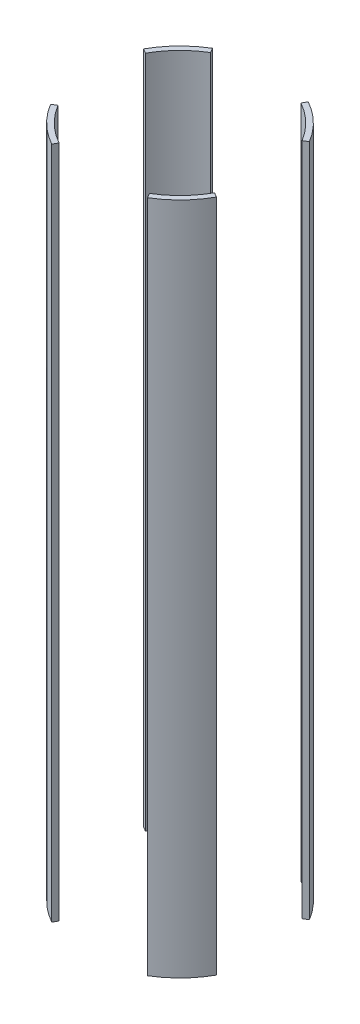
ISO-10303-21;
HEADER;
FILE_DESCRIPTION(('STEP AP214'),'2;1');
FILE_NAME('part.step','',(''),(''),'','','');
FILE_SCHEMA(('AUTOMOTIVE_DESIGN { 1 0 10303 214 1 1 1 1 }'));
ENDSEC;
DATA;
#1=APPLICATION_CONTEXT('core data for automotive mechanical design processes');
#2=APPLICATION_PROTOCOL_DEFINITION('international standard','automotive_design',2000,#1);
#3=PRODUCT_CONTEXT('',#1,'mechanical');
#4=PRODUCT('Part','Part','',(#3));
#5=PRODUCT_RELATED_PRODUCT_CATEGORY('part','',(#4));
#6=PRODUCT_DEFINITION_FORMATION('','',#4);
#7=PRODUCT_DEFINITION_CONTEXT('part definition',#1,'design');
#8=PRODUCT_DEFINITION('design','',#6,#7);
#9=PRODUCT_DEFINITION_SHAPE('','',#8);
#10=(LENGTH_UNIT() NAMED_UNIT(*) SI_UNIT(.MILLI.,.METRE.));
#11=(NAMED_UNIT(*) PLANE_ANGLE_UNIT() SI_UNIT($,.RADIAN.));
#12=(NAMED_UNIT(*) SI_UNIT($,.STERADIAN.) SOLID_ANGLE_UNIT());
#13=UNCERTAINTY_MEASURE_WITH_UNIT(LENGTH_MEASURE(1.E-05),#10,'distance_accuracy_value','');
#14=(GEOMETRIC_REPRESENTATION_CONTEXT(3) GLOBAL_UNCERTAINTY_ASSIGNED_CONTEXT((#13)) GLOBAL_UNIT_ASSIGNED_CONTEXT((#10,
#11,#12)) REPRESENTATION_CONTEXT('',''));
#15=CARTESIAN_POINT('',(0.,0.,0.));
#16=DIRECTION('',(0.,0.,1.));
#17=DIRECTION('',(1.,0.,0.));
#18=AXIS2_PLACEMENT_3D('',#15,#16,#17);
#19=CARTESIAN_POINT('',(0.,-317.5,0.));
#20=DIRECTION('',(0.,1.,0.));
#21=DIRECTION('',(0.,0.,1.));
#22=AXIS2_PLACEMENT_3D('',#19,#20,#21);
#23=PLANE('',#22);
#24=DIRECTION('',(0.48581550952375,0.,-0.874061376967418));
#25=VECTOR('',#24,1.);
#26=CARTESIAN_POINT('',(0.,-317.5,0.));
#27=LINE('',#26,#25);
#28=CARTESIAN_POINT('',(-43.1889987966614,-317.5,77.7040564124034));
#29=VERTEX_POINT('',#28);
#30=CARTESIAN_POINT('',(-40.7210560082808,-317.5,73.263824617409));
#31=VERTEX_POINT('',#30);
#32=EDGE_CURVE('E13',#29,#31,#27,.T.);
#33=ORIENTED_EDGE('',*,*,#32,.F.);
#34=CARTESIAN_POINT('',(0.,-317.5,0.));
#35=DIRECTION('',(0.,1.,0.));
#36=DIRECTION('',(0.,0.,1.));
#37=AXIS2_PLACEMENT_3D('',#34,#35,#36);
#38=CIRCLE('',#37,88.9);
#39=CARTESIAN_POINT('',(-76.2547983281261,-317.5,45.6991874319097));
#40=VERTEX_POINT('',#39);
#41=EDGE_CURVE('E274',#40,#29,#38,.T.);
#42=ORIENTED_EDGE('',*,*,#41,.F.);
#43=DIRECTION('',(0.857759261283758,0.,-0.514051602158714));
#44=VECTOR('',#43,1.);
#45=CARTESIAN_POINT('',(0.,-317.5,0.));
#46=LINE('',#45,#44);
#47=CARTESIAN_POINT('',(-71.8973812808046,-317.5,43.0878052929434));
#48=VERTEX_POINT('',#47);
#49=EDGE_CURVE('E269',#40,#48,#46,.T.);
#50=ORIENTED_EDGE('',*,*,#49,.T.);
#51=CARTESIAN_POINT('',(0.,-317.5,0.));
#52=DIRECTION('',(0.,1.,0.));
#53=DIRECTION('',(0.,0.,1.));
#54=AXIS2_PLACEMENT_3D('',#51,#52,#53);
#55=CIRCLE('',#54,83.82);
#56=EDGE_CURVE('E228',#48,#31,#55,.T.);
#57=ORIENTED_EDGE('',*,*,#56,.T.);
#58=EDGE_LOOP('',(#33,#42,#50,#57));
#59=FACE_BOUND('',#58,.T.);
#60=ADVANCED_FACE('F225',(#59),#23,.F.);
#61=CARTESIAN_POINT('',(0.,317.5,0.));
#62=DIRECTION('',(0.,1.,0.));
#63=DIRECTION('',(0.,0.,1.));
#64=AXIS2_PLACEMENT_3D('',#61,#62,#63);
#65=PLANE('',#64);
#66=CARTESIAN_POINT('',(0.,317.5,0.));
#67=DIRECTION('',(0.,1.,0.));
#68=DIRECTION('',(0.,0.,1.));
#69=AXIS2_PLACEMENT_3D('',#66,#67,#68);
#70=CIRCLE('',#69,88.9);
#71=CARTESIAN_POINT('',(-76.2547983281261,317.5,45.6991874319097));
#72=VERTEX_POINT('',#71);
#73=CARTESIAN_POINT('',(-43.1889987966614,317.5,77.7040564124034));
#74=VERTEX_POINT('',#73);
#75=EDGE_CURVE('E280',#72,#74,#70,.T.);
#76=ORIENTED_EDGE('',*,*,#75,.T.);
#77=DIRECTION('',(0.48581550952375,0.,-0.874061376967418));
#78=VECTOR('',#77,1.);
#79=CARTESIAN_POINT('',(0.,317.5,0.));
#80=LINE('',#79,#78);
#81=CARTESIAN_POINT('',(-40.7210560082808,317.5,73.263824617409));
#82=VERTEX_POINT('',#81);
#83=EDGE_CURVE('E241',#74,#82,#80,.T.);
#84=ORIENTED_EDGE('',*,*,#83,.T.);
#85=CARTESIAN_POINT('',(0.,317.5,0.));
#86=DIRECTION('',(0.,1.,0.));
#87=DIRECTION('',(0.,0.,1.));
#88=AXIS2_PLACEMENT_3D('',#85,#86,#87);
#89=CIRCLE('',#88,83.82);
#90=CARTESIAN_POINT('',(-71.8973812808046,317.5,43.0878052929434));
#91=VERTEX_POINT('',#90);
#92=EDGE_CURVE('E282',#91,#82,#89,.T.);
#93=ORIENTED_EDGE('',*,*,#92,.F.);
#94=DIRECTION('',(0.857759261283759,0.,-0.514051602158714));
#95=VECTOR('',#94,1.);
#96=CARTESIAN_POINT('',(0.,317.5,0.));
#97=LINE('',#96,#95);
#98=EDGE_CURVE('E266',#72,#91,#97,.T.);
#99=ORIENTED_EDGE('',*,*,#98,.F.);
#100=EDGE_LOOP('',(#76,#84,#93,#99));
#101=FACE_BOUND('',#100,.T.);
#102=ADVANCED_FACE('F279',(#101),#65,.T.);
#103=CARTESIAN_POINT('',(0.,317.5,0.));
#104=DIRECTION('',(0.,-1.,0.));
#105=DIRECTION('',(0.,0.,-1.));
#106=AXIS2_PLACEMENT_3D('',#103,#104,#105);
#107=CYLINDRICAL_SURFACE('',#106,88.9);
#108=DIRECTION('',(0.,-1.,0.));
#109=VECTOR('',#108,1.);
#110=CARTESIAN_POINT('',(-43.1889987966614,317.5,77.7040564124034));
#111=LINE('',#110,#109);
#112=EDGE_CURVE('E233',#74,#29,#111,.T.);
#113=ORIENTED_EDGE('',*,*,#112,.F.);
#114=ORIENTED_EDGE('',*,*,#75,.F.);
#115=DIRECTION('',(0.,-1.,0.));
#116=VECTOR('',#115,1.);
#117=CARTESIAN_POINT('',(-76.2547983281261,317.5,45.6991874319097));
#118=LINE('',#117,#116);
#119=EDGE_CURVE('E263',#72,#40,#118,.T.);
#120=ORIENTED_EDGE('',*,*,#119,.T.);
#121=ORIENTED_EDGE('',*,*,#41,.T.);
#122=EDGE_LOOP('',(#113,#114,#120,#121));
#123=FACE_BOUND('',#122,.T.);
#124=ADVANCED_FACE('F285',(#123),#107,.T.);
#125=CARTESIAN_POINT('',(0.,317.5,0.));
#126=DIRECTION('',(0.,-1.,0.));
#127=DIRECTION('',(0.,0.,-1.));
#128=AXIS2_PLACEMENT_3D('',#125,#126,#127);
#129=CYLINDRICAL_SURFACE('',#128,83.82);
#130=ORIENTED_EDGE('',*,*,#92,.T.);
#131=DIRECTION('',(0.,-1.,0.));
#132=VECTOR('',#131,1.);
#133=CARTESIAN_POINT('',(-40.7210560082807,317.5,73.2638246174089));
#134=LINE('',#133,#132);
#135=EDGE_CURVE('E245',#82,#31,#134,.T.);
#136=ORIENTED_EDGE('',*,*,#135,.T.);
#137=ORIENTED_EDGE('',*,*,#56,.F.);
#138=DIRECTION('',(0.,-1.,0.));
#139=VECTOR('',#138,1.);
#140=CARTESIAN_POINT('',(-71.8973812808046,317.5,43.0878052929434));
#141=LINE('',#140,#139);
#142=EDGE_CURVE('E283',#91,#48,#141,.T.);
#143=ORIENTED_EDGE('',*,*,#142,.F.);
#144=EDGE_LOOP('',(#130,#136,#137,#143));
#145=FACE_BOUND('',#144,.T.);
#146=ADVANCED_FACE('F299',(#145),#129,.F.);
#147=CARTESIAN_POINT('',(0.,-317.5,0.));
#148=DIRECTION('',(0.514051602158714,0.,0.857759261283758));
#149=DIRECTION('',(0.857759261283759,0.,-0.514051602158714));
#150=AXIS2_PLACEMENT_3D('',#147,#148,#149);
#151=PLANE('',#150);
#152=ORIENTED_EDGE('',*,*,#142,.T.);
#153=ORIENTED_EDGE('',*,*,#49,.F.);
#154=ORIENTED_EDGE('',*,*,#119,.F.);
#155=ORIENTED_EDGE('',*,*,#98,.T.);
#156=EDGE_LOOP('',(#152,#153,#154,#155));
#157=FACE_BOUND('',#156,.T.);
#158=ADVANCED_FACE('F265',(#157),#151,.F.);
#159=CARTESIAN_POINT('',(0.,-317.5,0.));
#160=DIRECTION('',(0.874061376967418,0.,0.48581550952375));
#161=DIRECTION('',(0.485815509523751,0.,-0.874061376967418));
#162=AXIS2_PLACEMENT_3D('',#159,#160,#161);
#163=PLANE('',#162);
#164=ORIENTED_EDGE('',*,*,#112,.T.);
#165=ORIENTED_EDGE('',*,*,#32,.T.);
#166=ORIENTED_EDGE('',*,*,#135,.F.);
#167=ORIENTED_EDGE('',*,*,#83,.F.);
#168=EDGE_LOOP('',(#164,#165,#166,#167));
#169=FACE_BOUND('',#168,.T.);
#170=ADVANCED_FACE('F297',(#169),#163,.T.);
#171=CLOSED_SHELL('',(#60,#102,#124,#146,#158,#170));
#172=MANIFOLD_SOLID_BREP('B2',#171);
#173=CARTESIAN_POINT('',(0.,317.5,0.));
#174=DIRECTION('',(0.,-1.,0.));
#175=DIRECTION('',(0.,0.,-1.));
#176=AXIS2_PLACEMENT_3D('',#173,#174,#175);
#177=CYLINDRICAL_SURFACE('',#176,83.82);
#178=DIRECTION('',(0.,-1.,0.));
#179=VECTOR('',#178,1.);
#180=CARTESIAN_POINT('',(-73.2638246174091,317.5,-40.7210560082805));
#181=LINE('',#180,#179);
#182=CARTESIAN_POINT('',(-73.2638246174091,-317.5,-40.7210560082805));
#183=VERTEX_POINT('',#182);
#184=CARTESIAN_POINT('',(-73.2638246174091,317.5,-40.7210560082805));
#185=VERTEX_POINT('',#184);
#186=EDGE_CURVE('E367',#183,#185,#181,.F.);
#187=ORIENTED_EDGE('',*,*,#186,.F.);
#188=CARTESIAN_POINT('',(0.,-317.5,0.));
#189=DIRECTION('',(0.,1.,0.));
#190=DIRECTION('',(0.,0.,1.));
#191=AXIS2_PLACEMENT_3D('',#188,#189,#190);
#192=CIRCLE('',#191,83.82);
#193=CARTESIAN_POINT('',(-43.0878052929431,-317.5,-71.8973812808048));
#194=VERTEX_POINT('',#193);
#195=EDGE_CURVE('E361',#194,#183,#192,.T.);
#196=ORIENTED_EDGE('',*,*,#195,.F.);
#197=DIRECTION('',(0.,-1.,0.));
#198=VECTOR('',#197,1.);
#199=CARTESIAN_POINT('',(-43.0878052929431,317.5,-71.8973812808048));
#200=LINE('',#199,#198);
#201=CARTESIAN_POINT('',(-43.0878052929431,317.5,-71.8973812808048));
#202=VERTEX_POINT('',#201);
#203=EDGE_CURVE('E415',#202,#194,#200,.T.);
#204=ORIENTED_EDGE('',*,*,#203,.F.);
#205=CARTESIAN_POINT('',(0.,317.5,0.));
#206=DIRECTION('',(0.,1.,0.));
#207=DIRECTION('',(0.,0.,1.));
#208=AXIS2_PLACEMENT_3D('',#205,#206,#207);
#209=CIRCLE('',#208,83.82);
#210=EDGE_CURVE('E421',#202,#185,#209,.T.);
#211=ORIENTED_EDGE('',*,*,#210,.T.);
#212=EDGE_LOOP('',(#187,#196,#204,#211));
#213=FACE_BOUND('',#212,.T.);
#214=ADVANCED_FACE('F358',(#213),#177,.F.);
#215=CARTESIAN_POINT('',(0.,317.5,0.));
#216=DIRECTION('',(0.,-1.,0.));
#217=DIRECTION('',(0.,0.,-1.));
#218=AXIS2_PLACEMENT_3D('',#215,#216,#217);
#219=CYLINDRICAL_SURFACE('',#218,88.9);
#220=CARTESIAN_POINT('',(0.,-317.5,0.));
#221=DIRECTION('',(0.,1.,0.));
#222=DIRECTION('',(0.,0.,1.));
#223=AXIS2_PLACEMENT_3D('',#220,#221,#222);
#224=CIRCLE('',#223,88.9);
#225=CARTESIAN_POINT('',(-45.6991874319094,-317.5,-76.2547983281263));
#226=VERTEX_POINT('',#225);
#227=CARTESIAN_POINT('',(-77.7040564124036,-317.5,-43.1889987966612));
#228=VERTEX_POINT('',#227);
#229=EDGE_CURVE('E407',#226,#228,#224,.T.);
#230=ORIENTED_EDGE('',*,*,#229,.T.);
#231=DIRECTION('',(0.,-1.,0.));
#232=VECTOR('',#231,1.);
#233=CARTESIAN_POINT('',(-77.7040564124036,317.5,-43.1889987966611));
#234=LINE('',#233,#232);
#235=CARTESIAN_POINT('',(-77.7040564124036,317.5,-43.1889987966612));
#236=VERTEX_POINT('',#235);
#237=EDGE_CURVE('E395',#228,#236,#234,.F.);
#238=ORIENTED_EDGE('',*,*,#237,.T.);
#239=CARTESIAN_POINT('',(0.,317.5,0.));
#240=DIRECTION('',(0.,1.,0.));
#241=DIRECTION('',(0.,0.,1.));
#242=AXIS2_PLACEMENT_3D('',#239,#240,#241);
#243=CIRCLE('',#242,88.9);
#244=CARTESIAN_POINT('',(-45.6991874319094,317.5,-76.2547983281263));
#245=VERTEX_POINT('',#244);
#246=EDGE_CURVE('E405',#245,#236,#243,.T.);
#247=ORIENTED_EDGE('',*,*,#246,.F.);
#248=DIRECTION('',(0.,-1.,0.));
#249=VECTOR('',#248,1.);
#250=CARTESIAN_POINT('',(-45.6991874319094,317.5,-76.2547983281263));
#251=LINE('',#250,#249);
#252=EDGE_CURVE('E408',#245,#226,#251,.T.);
#253=ORIENTED_EDGE('',*,*,#252,.T.);
#254=EDGE_LOOP('',(#230,#238,#247,#253));
#255=FACE_BOUND('',#254,.T.);
#256=ADVANCED_FACE('F403',(#255),#219,.T.);
#257=CARTESIAN_POINT('',(0.,-317.5,0.));
#258=DIRECTION('',(0.,1.,0.));
#259=DIRECTION('',(0.,0.,1.));
#260=AXIS2_PLACEMENT_3D('',#257,#258,#259);
#261=PLANE('',#260);
#262=ORIENTED_EDGE('',*,*,#195,.T.);
#263=DIRECTION('',(-0.87406137696742,0.,-0.485815509523748));
#264=VECTOR('',#263,1.);
#265=CARTESIAN_POINT('',(0.,-317.5,0.));
#266=LINE('',#265,#264);
#267=EDGE_CURVE('E375',#183,#228,#266,.T.);
#268=ORIENTED_EDGE('',*,*,#267,.T.);
#269=ORIENTED_EDGE('',*,*,#229,.F.);
#270=DIRECTION('',(0.514051602158711,0.,0.85775926128376));
#271=VECTOR('',#270,1.);
#272=CARTESIAN_POINT('',(0.,-317.5,0.));
#273=LINE('',#272,#271);
#274=EDGE_CURVE('E413',#226,#194,#273,.T.);
#275=ORIENTED_EDGE('',*,*,#274,.T.);
#276=EDGE_LOOP('',(#262,#268,#269,#275));
#277=FACE_BOUND('',#276,.T.);
#278=ADVANCED_FACE('F431',(#277),#261,.F.);
#279=CARTESIAN_POINT('',(0.,317.5,0.));
#280=DIRECTION('',(0.,1.,0.));
#281=DIRECTION('',(0.,0.,1.));
#282=AXIS2_PLACEMENT_3D('',#279,#280,#281);
#283=PLANE('',#282);
#284=DIRECTION('',(-0.87406137696742,0.,-0.485815509523748));
#285=VECTOR('',#284,1.);
#286=CARTESIAN_POINT('',(0.,317.5,0.));
#287=LINE('',#286,#285);
#288=EDGE_CURVE('E223',#185,#236,#287,.T.);
#289=ORIENTED_EDGE('',*,*,#288,.F.);
#290=ORIENTED_EDGE('',*,*,#210,.F.);
#291=DIRECTION('',(0.514051602158711,0.,0.85775926128376));
#292=VECTOR('',#291,1.);
#293=CARTESIAN_POINT('',(0.,317.5,0.));
#294=LINE('',#293,#292);
#295=EDGE_CURVE('E412',#245,#202,#294,.T.);
#296=ORIENTED_EDGE('',*,*,#295,.F.);
#297=ORIENTED_EDGE('',*,*,#246,.T.);
#298=EDGE_LOOP('',(#289,#290,#296,#297));
#299=FACE_BOUND('',#298,.T.);
#300=ADVANCED_FACE('F411',(#299),#283,.T.);
#301=CARTESIAN_POINT('',(0.,-317.5,0.));
#302=DIRECTION('',(-0.85775926128376,0.,0.514051602158711));
#303=DIRECTION('',(0.514051602158711,0.,0.857759261283761));
#304=AXIS2_PLACEMENT_3D('',#301,#302,#303);
#305=PLANE('',#304);
#306=ORIENTED_EDGE('',*,*,#295,.T.);
#307=ORIENTED_EDGE('',*,*,#203,.T.);
#308=ORIENTED_EDGE('',*,*,#274,.F.);
#309=ORIENTED_EDGE('',*,*,#252,.F.);
#310=EDGE_LOOP('',(#306,#307,#308,#309));
#311=FACE_BOUND('',#310,.T.);
#312=ADVANCED_FACE('F432',(#311),#305,.F.);
#313=CARTESIAN_POINT('',(0.,-317.5,0.));
#314=DIRECTION('',(0.485815509523747,0.,-0.87406137696742));
#315=DIRECTION('',(-0.87406137696742,0.,-0.485815509523748));
#316=AXIS2_PLACEMENT_3D('',#313,#314,#315);
#317=PLANE('',#316);
#318=ORIENTED_EDGE('',*,*,#186,.T.);
#319=ORIENTED_EDGE('',*,*,#288,.T.);
#320=ORIENTED_EDGE('',*,*,#237,.F.);
#321=ORIENTED_EDGE('',*,*,#267,.F.);
#322=EDGE_LOOP('',(#318,#319,#320,#321));
#323=FACE_BOUND('',#322,.T.);
#324=ADVANCED_FACE('F394',(#323),#317,.F.);
#325=CLOSED_SHELL('',(#214,#256,#278,#300,#312,#324));
#326=MANIFOLD_SOLID_BREP('B7',#325);
#327=CARTESIAN_POINT('',(0.,317.5,0.));
#328=DIRECTION('',(0.,1.,0.));
#329=DIRECTION('',(0.,0.,1.));
#330=AXIS2_PLACEMENT_3D('',#327,#328,#329);
#331=PLANE('',#330);
#332=DIRECTION('',(0.485815509523751,0.,-0.874061376967418));
#333=VECTOR('',#332,1.);
#334=CARTESIAN_POINT('',(0.,317.5,0.));
#335=LINE('',#334,#333);
#336=CARTESIAN_POINT('',(40.7210560082808,317.5,-73.2638246174089));
#337=VERTEX_POINT('',#336);
#338=CARTESIAN_POINT('',(43.1889987966614,317.5,-77.7040564124034));
#339=VERTEX_POINT('',#338);
#340=EDGE_CURVE('E356',#337,#339,#335,.T.);
#341=ORIENTED_EDGE('',*,*,#340,.F.);
#342=CARTESIAN_POINT('',(0.,317.5,0.));
#343=DIRECTION('',(0.,1.,0.));
#344=DIRECTION('',(0.,0.,1.));
#345=AXIS2_PLACEMENT_3D('',#342,#343,#344);
#346=CIRCLE('',#345,83.82);
#347=CARTESIAN_POINT('',(71.8973812808046,317.5,-43.0878052929434));
#348=VERTEX_POINT('',#347);
#349=EDGE_CURVE('E538',#348,#337,#346,.T.);
#350=ORIENTED_EDGE('',*,*,#349,.F.);
#351=DIRECTION('',(0.857759261283759,0.,-0.514051602158714));
#352=VECTOR('',#351,1.);
#353=CARTESIAN_POINT('',(0.,317.5,0.));
#354=LINE('',#353,#352);
#355=CARTESIAN_POINT('',(76.2547983281261,317.5,-45.6991874319097));
#356=VERTEX_POINT('',#355);
#357=EDGE_CURVE('E551',#348,#356,#354,.T.);
#358=ORIENTED_EDGE('',*,*,#357,.T.);
#359=CARTESIAN_POINT('',(0.,317.5,0.));
#360=DIRECTION('',(0.,1.,0.));
#361=DIRECTION('',(0.,0.,1.));
#362=AXIS2_PLACEMENT_3D('',#359,#360,#361);
#363=CIRCLE('',#362,88.9);
#364=EDGE_CURVE('E540',#356,#339,#363,.T.);
#365=ORIENTED_EDGE('',*,*,#364,.T.);
#366=EDGE_LOOP('',(#341,#350,#358,#365));
#367=FACE_BOUND('',#366,.T.);
#368=ADVANCED_FACE('F490',(#367),#331,.T.);
#369=CARTESIAN_POINT('',(0.,-317.5,0.));
#370=DIRECTION('',(0.,1.,0.));
#371=DIRECTION('',(0.,0.,1.));
#372=AXIS2_PLACEMENT_3D('',#369,#370,#371);
#373=PLANE('',#372);
#374=CARTESIAN_POINT('',(0.,-317.5,0.));
#375=DIRECTION('',(0.,1.,0.));
#376=DIRECTION('',(0.,0.,1.));
#377=AXIS2_PLACEMENT_3D('',#374,#375,#376);
#378=CIRCLE('',#377,83.82);
#379=CARTESIAN_POINT('',(71.8973812808046,-317.5,-43.0878052929434));
#380=VERTEX_POINT('',#379);
#381=CARTESIAN_POINT('',(40.7210560082808,-317.5,-73.2638246174089));
#382=VERTEX_POINT('',#381);
#383=EDGE_CURVE('E493',#380,#382,#378,.T.);
#384=ORIENTED_EDGE('',*,*,#383,.T.);
#385=DIRECTION('',(0.485815509523751,0.,-0.874061376967418));
#386=VECTOR('',#385,1.);
#387=CARTESIAN_POINT('',(0.,-317.5,0.));
#388=LINE('',#387,#386);
#389=CARTESIAN_POINT('',(43.1889987966614,-317.5,-77.7040564124034));
#390=VERTEX_POINT('',#389);
#391=EDGE_CURVE('E524',#382,#390,#388,.T.);
#392=ORIENTED_EDGE('',*,*,#391,.T.);
#393=CARTESIAN_POINT('',(0.,-317.5,0.));
#394=DIRECTION('',(0.,1.,0.));
#395=DIRECTION('',(0.,0.,1.));
#396=AXIS2_PLACEMENT_3D('',#393,#394,#395);
#397=CIRCLE('',#396,88.9);
#398=CARTESIAN_POINT('',(76.2547983281261,-317.5,-45.6991874319097));
#399=VERTEX_POINT('',#398);
#400=EDGE_CURVE('E548',#399,#390,#397,.T.);
#401=ORIENTED_EDGE('',*,*,#400,.F.);
#402=DIRECTION('',(0.857759261283759,0.,-0.514051602158714));
#403=VECTOR('',#402,1.);
#404=CARTESIAN_POINT('',(0.,-317.5,0.));
#405=LINE('',#404,#403);
#406=EDGE_CURVE('E532',#380,#399,#405,.T.);
#407=ORIENTED_EDGE('',*,*,#406,.F.);
#408=EDGE_LOOP('',(#384,#392,#401,#407));
#409=FACE_BOUND('',#408,.T.);
#410=ADVANCED_FACE('F564',(#409),#373,.F.);
#411=CARTESIAN_POINT('',(0.,317.5,0.));
#412=DIRECTION('',(0.,-1.,0.));
#413=DIRECTION('',(0.,0.,-1.));
#414=AXIS2_PLACEMENT_3D('',#411,#412,#413);
#415=CYLINDRICAL_SURFACE('',#414,88.9);
#416=ORIENTED_EDGE('',*,*,#400,.T.);
#417=DIRECTION('',(0.,-1.,0.));
#418=VECTOR('',#417,1.);
#419=CARTESIAN_POINT('',(43.1889987966614,317.5,-77.7040564124034));
#420=LINE('',#419,#418);
#421=EDGE_CURVE('E507',#390,#339,#420,.F.);
#422=ORIENTED_EDGE('',*,*,#421,.T.);
#423=ORIENTED_EDGE('',*,*,#364,.F.);
#424=DIRECTION('',(0.,-1.,0.));
#425=VECTOR('',#424,1.);
#426=CARTESIAN_POINT('',(76.2547983281261,317.5,-45.6991874319097));
#427=LINE('',#426,#425);
#428=EDGE_CURVE('E544',#399,#356,#427,.F.);
#429=ORIENTED_EDGE('',*,*,#428,.F.);
#430=EDGE_LOOP('',(#416,#422,#423,#429));
#431=FACE_BOUND('',#430,.T.);
#432=ADVANCED_FACE('F563',(#431),#415,.T.);
#433=CARTESIAN_POINT('',(0.,317.5,0.));
#434=DIRECTION('',(0.,-1.,0.));
#435=DIRECTION('',(0.,0.,-1.));
#436=AXIS2_PLACEMENT_3D('',#433,#434,#435);
#437=CYLINDRICAL_SURFACE('',#436,83.82);
#438=DIRECTION('',(0.,-1.,0.));
#439=VECTOR('',#438,1.);
#440=CARTESIAN_POINT('',(40.7210560082808,317.5,-73.2638246174089));
#441=LINE('',#440,#439);
#442=EDGE_CURVE('E499',#382,#337,#441,.F.);
#443=ORIENTED_EDGE('',*,*,#442,.F.);
#444=ORIENTED_EDGE('',*,*,#383,.F.);
#445=DIRECTION('',(0.,-1.,0.));
#446=VECTOR('',#445,1.);
#447=CARTESIAN_POINT('',(71.8973812808046,317.5,-43.0878052929434));
#448=LINE('',#447,#446);
#449=EDGE_CURVE('E543',#380,#348,#448,.F.);
#450=ORIENTED_EDGE('',*,*,#449,.T.);
#451=ORIENTED_EDGE('',*,*,#349,.T.);
#452=EDGE_LOOP('',(#443,#444,#450,#451));
#453=FACE_BOUND('',#452,.T.);
#454=ADVANCED_FACE('F542',(#453),#437,.F.);
#455=CARTESIAN_POINT('',(0.,-317.5,0.));
#456=DIRECTION('',(0.514051602158714,0.,0.857759261283758));
#457=DIRECTION('',(0.857759261283759,0.,-0.514051602158714));
#458=AXIS2_PLACEMENT_3D('',#455,#456,#457);
#459=PLANE('',#458);
#460=ORIENTED_EDGE('',*,*,#428,.T.);
#461=ORIENTED_EDGE('',*,*,#357,.F.);
#462=ORIENTED_EDGE('',*,*,#449,.F.);
#463=ORIENTED_EDGE('',*,*,#406,.T.);
#464=EDGE_LOOP('',(#460,#461,#462,#463));
#465=FACE_BOUND('',#464,.T.);
#466=ADVANCED_FACE('F559',(#465),#459,.T.);
#467=CARTESIAN_POINT('',(0.,-317.5,0.));
#468=DIRECTION('',(0.874061376967418,0.,0.485815509523751));
#469=DIRECTION('',(0.485815509523751,0.,-0.874061376967418));
#470=AXIS2_PLACEMENT_3D('',#467,#468,#469);
#471=PLANE('',#470);
#472=ORIENTED_EDGE('',*,*,#391,.F.);
#473=ORIENTED_EDGE('',*,*,#442,.T.);
#474=ORIENTED_EDGE('',*,*,#340,.T.);
#475=ORIENTED_EDGE('',*,*,#421,.F.);
#476=EDGE_LOOP('',(#472,#473,#474,#475));
#477=FACE_BOUND('',#476,.T.);
#478=ADVANCED_FACE('F527',(#477),#471,.F.);
#479=CLOSED_SHELL('',(#368,#410,#432,#454,#466,#478));
#480=MANIFOLD_SOLID_BREP('B217',#479);
#481=CARTESIAN_POINT('',(0.,-317.5,0.));
#482=DIRECTION('',(0.485815509523748,0.,-0.874061376967419));
#483=DIRECTION('',(-0.87406137696742,0.,-0.485815509523748));
#484=AXIS2_PLACEMENT_3D('',#481,#482,#483);
#485=PLANE('',#484);
#486=DIRECTION('',(0.,-1.,0.));
#487=VECTOR('',#486,1.);
#488=CARTESIAN_POINT('',(77.7040564124036,317.5,43.1889987966612));
#489=LINE('',#488,#487);
#490=CARTESIAN_POINT('',(77.7040564124036,317.5,43.1889987966612));
#491=VERTEX_POINT('',#490);
#492=CARTESIAN_POINT('',(77.7040564124036,-317.5,43.1889987966612));
#493=VERTEX_POINT('',#492);
#494=EDGE_CURVE('E671',#491,#493,#489,.T.);
#495=ORIENTED_EDGE('',*,*,#494,.T.);
#496=DIRECTION('',(-0.87406137696742,0.,-0.485815509523748));
#497=VECTOR('',#496,1.);
#498=CARTESIAN_POINT('',(0.,-317.5,0.));
#499=LINE('',#498,#497);
#500=CARTESIAN_POINT('',(73.2638246174091,-317.5,40.7210560082805));
#501=VERTEX_POINT('',#500);
#502=EDGE_CURVE('E680',#493,#501,#499,.T.);
#503=ORIENTED_EDGE('',*,*,#502,.T.);
#504=DIRECTION('',(0.,-1.,0.));
#505=VECTOR('',#504,1.);
#506=CARTESIAN_POINT('',(73.2638246174091,317.5,40.7210560082805));
#507=LINE('',#506,#505);
#508=CARTESIAN_POINT('',(73.2638246174091,317.5,40.7210560082805));
#509=VERTEX_POINT('',#508);
#510=EDGE_CURVE('E621',#509,#501,#507,.T.);
#511=ORIENTED_EDGE('',*,*,#510,.F.);
#512=DIRECTION('',(-0.87406137696742,0.,-0.485815509523748));
#513=VECTOR('',#512,1.);
#514=CARTESIAN_POINT('',(0.,317.5,0.));
#515=LINE('',#514,#513);
#516=EDGE_CURVE('E659',#491,#509,#515,.T.);
#517=ORIENTED_EDGE('',*,*,#516,.F.);
#518=EDGE_LOOP('',(#495,#503,#511,#517));
#519=FACE_BOUND('',#518,.T.);
#520=ADVANCED_FACE('F613',(#519),#485,.T.);
#521=CARTESIAN_POINT('',(0.,317.5,0.));
#522=DIRECTION('',(0.,-1.,0.));
#523=DIRECTION('',(0.,0.,-1.));
#524=AXIS2_PLACEMENT_3D('',#521,#522,#523);
#525=CYLINDRICAL_SURFACE('',#524,88.9);
#526=DIRECTION('',(0.,-1.,0.));
#527=VECTOR('',#526,1.);
#528=CARTESIAN_POINT('',(45.6991874319094,317.5,76.2547983281263));
#529=LINE('',#528,#527);
#530=CARTESIAN_POINT('',(45.6991874319095,-317.5,76.2547983281263));
#531=VERTEX_POINT('',#530);
#532=CARTESIAN_POINT('',(45.6991874319095,317.5,76.2547983281263));
#533=VERTEX_POINT('',#532);
#534=EDGE_CURVE('E653',#531,#533,#529,.F.);
#535=ORIENTED_EDGE('',*,*,#534,.F.);
#536=CARTESIAN_POINT('',(0.,-317.5,0.));
#537=DIRECTION('',(0.,1.,0.));
#538=DIRECTION('',(0.,0.,1.));
#539=AXIS2_PLACEMENT_3D('',#536,#537,#538);
#540=CIRCLE('',#539,88.9);
#541=EDGE_CURVE('E672',#531,#493,#540,.T.);
#542=ORIENTED_EDGE('',*,*,#541,.T.);
#543=ORIENTED_EDGE('',*,*,#494,.F.);
#544=CARTESIAN_POINT('',(0.,317.5,0.));
#545=DIRECTION('',(0.,1.,0.));
#546=DIRECTION('',(0.,0.,1.));
#547=AXIS2_PLACEMENT_3D('',#544,#545,#546);
#548=CIRCLE('',#547,88.9);
#549=EDGE_CURVE('E665',#533,#491,#548,.T.);
#550=ORIENTED_EDGE('',*,*,#549,.F.);
#551=EDGE_LOOP('',(#535,#542,#543,#550));
#552=FACE_BOUND('',#551,.T.);
#553=ADVANCED_FACE('F615',(#552),#525,.T.);
#554=CARTESIAN_POINT('',(0.,317.5,0.));
#555=DIRECTION('',(0.,-1.,0.));
#556=DIRECTION('',(0.,0.,-1.));
#557=AXIS2_PLACEMENT_3D('',#554,#555,#556);
#558=CYLINDRICAL_SURFACE('',#557,83.82);
#559=CARTESIAN_POINT('',(0.,-317.5,0.));
#560=DIRECTION('',(0.,1.,0.));
#561=DIRECTION('',(0.,0.,1.));
#562=AXIS2_PLACEMENT_3D('',#559,#560,#561);
#563=CIRCLE('',#562,83.82);
#564=CARTESIAN_POINT('',(43.0878052929432,-317.5,71.8973812808048));
#565=VERTEX_POINT('',#564);
#566=EDGE_CURVE('E635',#565,#501,#563,.T.);
#567=ORIENTED_EDGE('',*,*,#566,.F.);
#568=DIRECTION('',(0.,-1.,0.));
#569=VECTOR('',#568,1.);
#570=CARTESIAN_POINT('',(43.0878052929432,317.5,71.8973812808048));
#571=LINE('',#570,#569);
#572=CARTESIAN_POINT('',(43.0878052929432,317.5,71.8973812808048));
#573=VERTEX_POINT('',#572);
#574=EDGE_CURVE('E488',#565,#573,#571,.F.);
#575=ORIENTED_EDGE('',*,*,#574,.T.);
#576=CARTESIAN_POINT('',(0.,317.5,0.));
#577=DIRECTION('',(0.,1.,0.));
#578=DIRECTION('',(0.,0.,1.));
#579=AXIS2_PLACEMENT_3D('',#576,#577,#578);
#580=CIRCLE('',#579,83.82);
#581=EDGE_CURVE('E667',#573,#509,#580,.T.);
#582=ORIENTED_EDGE('',*,*,#581,.T.);
#583=ORIENTED_EDGE('',*,*,#510,.T.);
#584=EDGE_LOOP('',(#567,#575,#582,#583));
#585=FACE_BOUND('',#584,.T.);
#586=ADVANCED_FACE('F686',(#585),#558,.F.);
#587=CARTESIAN_POINT('',(0.,317.5,0.));
#588=DIRECTION('',(0.,1.,0.));
#589=DIRECTION('',(0.,0.,1.));
#590=AXIS2_PLACEMENT_3D('',#587,#588,#589);
#591=PLANE('',#590);
#592=ORIENTED_EDGE('',*,*,#581,.F.);
#593=DIRECTION('',(0.514051602158711,0.,0.85775926128376));
#594=VECTOR('',#593,1.);
#595=CARTESIAN_POINT('',(0.,317.5,0.));
#596=LINE('',#595,#594);
#597=EDGE_CURVE('E628',#573,#533,#596,.T.);
#598=ORIENTED_EDGE('',*,*,#597,.T.);
#599=ORIENTED_EDGE('',*,*,#549,.T.);
#600=ORIENTED_EDGE('',*,*,#516,.T.);
#601=EDGE_LOOP('',(#592,#598,#599,#600));
#602=FACE_BOUND('',#601,.T.);
#603=ADVANCED_FACE('F663',(#602),#591,.T.);
#604=CARTESIAN_POINT('',(0.,-317.5,0.));
#605=DIRECTION('',(0.,1.,0.));
#606=DIRECTION('',(0.,0.,1.));
#607=AXIS2_PLACEMENT_3D('',#604,#605,#606);
#608=PLANE('',#607);
#609=DIRECTION('',(0.514051602158711,0.,0.85775926128376));
#610=VECTOR('',#609,1.);
#611=CARTESIAN_POINT('',(0.,-317.5,0.));
#612=LINE('',#611,#610);
#613=EDGE_CURVE('E655',#565,#531,#612,.T.);
#614=ORIENTED_EDGE('',*,*,#613,.F.);
#615=ORIENTED_EDGE('',*,*,#566,.T.);
#616=ORIENTED_EDGE('',*,*,#502,.F.);
#617=ORIENTED_EDGE('',*,*,#541,.F.);
#618=EDGE_LOOP('',(#614,#615,#616,#617));
#619=FACE_BOUND('',#618,.T.);
#620=ADVANCED_FACE('F687',(#619),#608,.F.);
#621=CARTESIAN_POINT('',(0.,-317.5,0.));
#622=DIRECTION('',(-0.85775926128376,0.,0.514051602158711));
#623=DIRECTION('',(0.514051602158711,0.,0.85775926128376));
#624=AXIS2_PLACEMENT_3D('',#621,#622,#623);
#625=PLANE('',#624);
#626=ORIENTED_EDGE('',*,*,#534,.T.);
#627=ORIENTED_EDGE('',*,*,#597,.F.);
#628=ORIENTED_EDGE('',*,*,#574,.F.);
#629=ORIENTED_EDGE('',*,*,#613,.T.);
#630=EDGE_LOOP('',(#626,#627,#628,#629));
#631=FACE_BOUND('',#630,.T.);
#632=ADVANCED_FACE('F654',(#631),#625,.T.);
#633=CLOSED_SHELL('',(#520,#553,#586,#603,#620,#632));
#634=MANIFOLD_SOLID_BREP('B350',#633);
#635=ADVANCED_BREP_SHAPE_REPRESENTATION('',(#18,#172,#326,#480,#634),#14);
#636=SHAPE_DEFINITION_REPRESENTATION(#9,#635);
ENDSEC;
END-ISO-10303-21;
